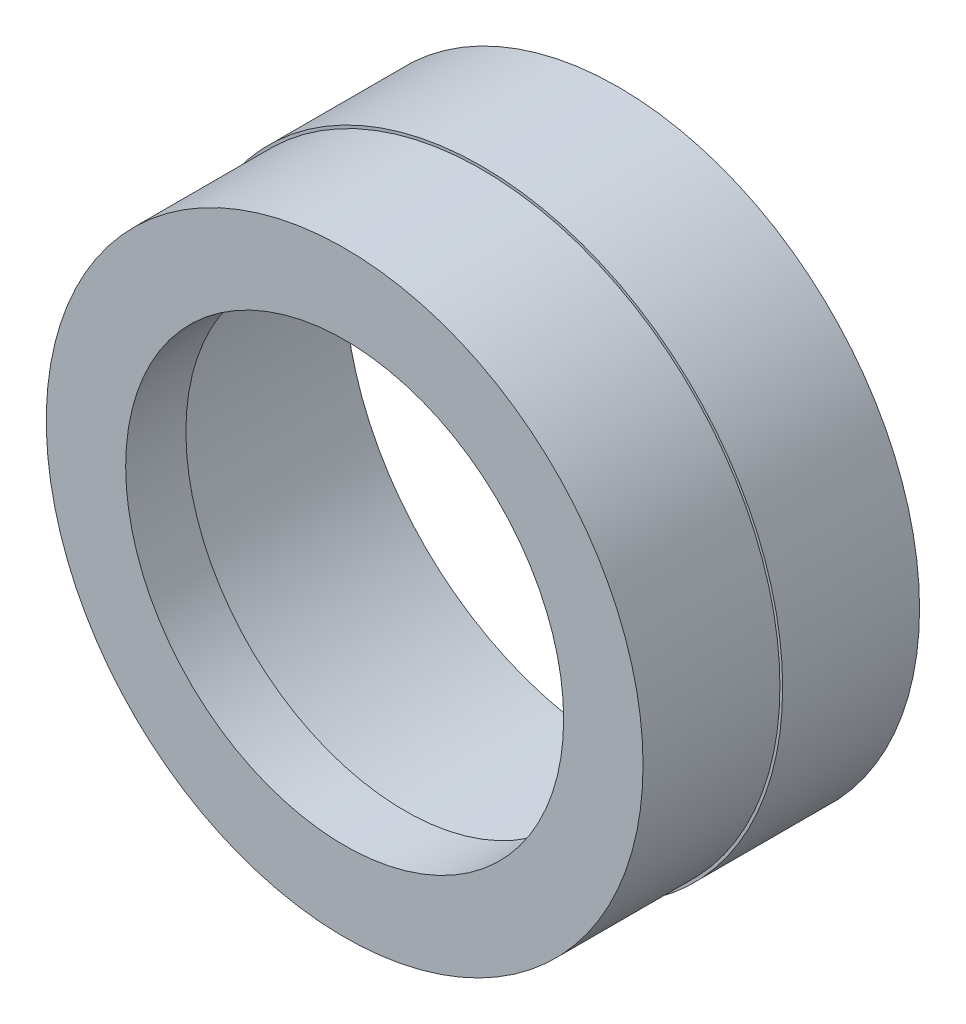
ISO-10303-21;
HEADER;
FILE_DESCRIPTION(('STEP AP214'),'2;1');
FILE_NAME('part.step','',(''),(''),'','','');
FILE_SCHEMA(('AUTOMOTIVE_DESIGN { 1 0 10303 214 1 1 1 1 }'));
ENDSEC;
DATA;
#1=APPLICATION_CONTEXT('core data for automotive mechanical design processes');
#2=APPLICATION_PROTOCOL_DEFINITION('international standard','automotive_design',2000,#1);
#3=PRODUCT_CONTEXT('',#1,'mechanical');
#4=PRODUCT('Part','Part','',(#3));
#5=PRODUCT_RELATED_PRODUCT_CATEGORY('part','',(#4));
#6=PRODUCT_DEFINITION_FORMATION('','',#4);
#7=PRODUCT_DEFINITION_CONTEXT('part definition',#1,'design');
#8=PRODUCT_DEFINITION('design','',#6,#7);
#9=PRODUCT_DEFINITION_SHAPE('','',#8);
#10=(LENGTH_UNIT() NAMED_UNIT(*) SI_UNIT(.MILLI.,.METRE.));
#11=(NAMED_UNIT(*) PLANE_ANGLE_UNIT() SI_UNIT($,.RADIAN.));
#12=(NAMED_UNIT(*) SI_UNIT($,.STERADIAN.) SOLID_ANGLE_UNIT());
#13=UNCERTAINTY_MEASURE_WITH_UNIT(LENGTH_MEASURE(1.E-05),#10,'distance_accuracy_value','');
#14=(GEOMETRIC_REPRESENTATION_CONTEXT(3) GLOBAL_UNCERTAINTY_ASSIGNED_CONTEXT((#13)) GLOBAL_UNIT_ASSIGNED_CONTEXT((#10,
#11,#12)) REPRESENTATION_CONTEXT('',''));
#15=CARTESIAN_POINT('',(0.,0.,0.));
#16=DIRECTION('',(0.,0.,1.));
#17=DIRECTION('',(1.,0.,0.));
#18=AXIS2_PLACEMENT_3D('',#15,#16,#17);
#19=CARTESIAN_POINT('',(0.,0.,-5.));
#20=DIRECTION('',(0.,0.,1.));
#21=DIRECTION('',(1.,0.,0.));
#22=AXIS2_PLACEMENT_3D('',#19,#20,#21);
#23=CYLINDRICAL_SURFACE('',#22,5.5);
#24=CARTESIAN_POINT('',(0.,0.,-5.));
#25=DIRECTION('',(0.,0.,1.));
#26=DIRECTION('',(1.,0.,0.));
#27=AXIS2_PLACEMENT_3D('',#24,#25,#26);
#28=CIRCLE('',#27,5.5);
#29=CARTESIAN_POINT('',(5.5,0.,-5.));
#30=VERTEX_POINT('',#29);
#31=EDGE_CURVE('E13',#30,#30,#28,.T.);
#32=ORIENTED_EDGE('',*,*,#31,.T.);
#33=EDGE_LOOP('',(#32));
#34=FACE_BOUND('',#33,.T.);
#35=CARTESIAN_POINT('',(0.,0.,-2.5));
#36=DIRECTION('',(0.,0.,1.));
#37=DIRECTION('',(1.,0.,0.));
#38=AXIS2_PLACEMENT_3D('',#35,#36,#37);
#39=CIRCLE('',#38,5.5);
#40=CARTESIAN_POINT('',(5.5,0.,-2.5));
#41=VERTEX_POINT('',#40);
#42=EDGE_CURVE('E51',#41,#41,#39,.F.);
#43=ORIENTED_EDGE('',*,*,#42,.T.);
#44=EDGE_LOOP('',(#43));
#45=FACE_BOUND('',#44,.T.);
#46=ADVANCED_FACE('F48',(#34,#45),#23,.T.);
#47=CARTESIAN_POINT('',(0.,0.,0.));
#48=DIRECTION('',(0.,0.,1.));
#49=DIRECTION('',(1.,0.,0.));
#50=AXIS2_PLACEMENT_3D('',#47,#48,#49);
#51=PLANE('',#50);
#52=CARTESIAN_POINT('',(0.,0.,0.));
#53=DIRECTION('',(0.,0.,1.));
#54=DIRECTION('',(1.,0.,0.));
#55=AXIS2_PLACEMENT_3D('',#52,#53,#54);
#56=CIRCLE('',#55,4.);
#57=CARTESIAN_POINT('',(4.,0.,0.));
#58=VERTEX_POINT('',#57);
#59=EDGE_CURVE('E63',#58,#58,#56,.T.);
#60=ORIENTED_EDGE('',*,*,#59,.F.);
#61=EDGE_LOOP('',(#60));
#62=FACE_BOUND('',#61,.T.);
#63=CARTESIAN_POINT('',(0.,0.,0.));
#64=DIRECTION('',(0.,0.,1.));
#65=DIRECTION('',(1.,0.,0.));
#66=AXIS2_PLACEMENT_3D('',#63,#64,#65);
#67=CIRCLE('',#66,5.45);
#68=CARTESIAN_POINT('',(5.45,0.,0.));
#69=VERTEX_POINT('',#68);
#70=EDGE_CURVE('E70',#69,#69,#67,.T.);
#71=ORIENTED_EDGE('',*,*,#70,.T.);
#72=EDGE_LOOP('',(#71));
#73=FACE_BOUND('',#72,.T.);
#74=ADVANCED_FACE('F96',(#62,#73),#51,.T.);
#75=CARTESIAN_POINT('',(0.,0.,-5.));
#76=DIRECTION('',(0.,0.,1.));
#77=DIRECTION('',(1.,0.,0.));
#78=AXIS2_PLACEMENT_3D('',#75,#76,#77);
#79=PLANE('',#78);
#80=CARTESIAN_POINT('',(0.,0.,-5.));
#81=DIRECTION('',(0.,0.,-1.));
#82=DIRECTION('',(-1.,0.,0.));
#83=AXIS2_PLACEMENT_3D('',#80,#81,#82);
#84=CIRCLE('',#83,5.);
#85=CARTESIAN_POINT('',(-5.,0.,-5.));
#86=VERTEX_POINT('',#85);
#87=EDGE_CURVE('E59',#86,#86,#84,.T.);
#88=ORIENTED_EDGE('',*,*,#87,.F.);
#89=EDGE_LOOP('',(#88));
#90=FACE_BOUND('',#89,.T.);
#91=ORIENTED_EDGE('',*,*,#31,.F.);
#92=EDGE_LOOP('',(#91));
#93=FACE_BOUND('',#92,.T.);
#94=ADVANCED_FACE('F100',(#90,#93),#79,.F.);
#95=CARTESIAN_POINT('',(0.,0.,-1.1));
#96=DIRECTION('',(0.,0.,-1.));
#97=DIRECTION('',(-1.,0.,0.));
#98=AXIS2_PLACEMENT_3D('',#95,#96,#97);
#99=CYLINDRICAL_SURFACE('',#98,5.);
#100=CARTESIAN_POINT('',(0.,0.,-1.1));
#101=DIRECTION('',(0.,0.,-1.));
#102=DIRECTION('',(-1.,0.,0.));
#103=AXIS2_PLACEMENT_3D('',#100,#101,#102);
#104=CIRCLE('',#103,5.);
#105=CARTESIAN_POINT('',(-5.,0.,-1.1));
#106=VERTEX_POINT('',#105);
#107=EDGE_CURVE('E55',#106,#106,#104,.T.);
#108=ORIENTED_EDGE('',*,*,#107,.F.);
#109=EDGE_LOOP('',(#108));
#110=FACE_BOUND('',#109,.T.);
#111=ORIENTED_EDGE('',*,*,#87,.T.);
#112=EDGE_LOOP('',(#111));
#113=FACE_BOUND('',#112,.T.);
#114=ADVANCED_FACE('F105',(#110,#113),#99,.F.);
#115=CARTESIAN_POINT('',(0.,0.,-1.1));
#116=DIRECTION('',(0.,0.,-1.));
#117=DIRECTION('',(-1.,0.,0.));
#118=AXIS2_PLACEMENT_3D('',#115,#116,#117);
#119=PLANE('',#118);
#120=CARTESIAN_POINT('',(0.,0.,-1.1));
#121=DIRECTION('',(0.,0.,-1.));
#122=DIRECTION('',(-1.,0.,0.));
#123=AXIS2_PLACEMENT_3D('',#120,#121,#122);
#124=CIRCLE('',#123,4.);
#125=CARTESIAN_POINT('',(-4.,0.,-1.1));
#126=VERTEX_POINT('',#125);
#127=EDGE_CURVE('E65',#126,#126,#124,.F.);
#128=ORIENTED_EDGE('',*,*,#127,.T.);
#129=EDGE_LOOP('',(#128));
#130=FACE_BOUND('',#129,.T.);
#131=ORIENTED_EDGE('',*,*,#107,.T.);
#132=EDGE_LOOP('',(#131));
#133=FACE_BOUND('',#132,.T.);
#134=ADVANCED_FACE('F92',(#130,#133),#119,.T.);
#135=CARTESIAN_POINT('',(0.,0.,-5.001));
#136=DIRECTION('',(0.,0.,1.));
#137=DIRECTION('',(1.,0.,0.));
#138=AXIS2_PLACEMENT_3D('',#135,#136,#137);
#139=CYLINDRICAL_SURFACE('',#138,4.);
#140=ORIENTED_EDGE('',*,*,#127,.F.);
#141=EDGE_LOOP('',(#140));
#142=FACE_BOUND('',#141,.T.);
#143=ORIENTED_EDGE('',*,*,#59,.T.);
#144=EDGE_LOOP('',(#143));
#145=FACE_BOUND('',#144,.T.);
#146=ADVANCED_FACE('F85',(#142,#145),#139,.F.);
#147=CARTESIAN_POINT('',(0.,0.,-2.5));
#148=DIRECTION('',(0.,0.,1.));
#149=DIRECTION('',(1.,0.,0.));
#150=AXIS2_PLACEMENT_3D('',#147,#148,#149);
#151=PLANE('',#150);
#152=ORIENTED_EDGE('',*,*,#42,.F.);
#153=EDGE_LOOP('',(#152));
#154=FACE_BOUND('',#153,.T.);
#155=CARTESIAN_POINT('',(0.,0.,-2.5));
#156=DIRECTION('',(0.,0.,1.));
#157=DIRECTION('',(1.,0.,0.));
#158=AXIS2_PLACEMENT_3D('',#155,#156,#157);
#159=CIRCLE('',#158,5.45);
#160=CARTESIAN_POINT('',(5.45,0.,-2.5));
#161=VERTEX_POINT('',#160);
#162=EDGE_CURVE('E73',#161,#161,#159,.T.);
#163=ORIENTED_EDGE('',*,*,#162,.F.);
#164=EDGE_LOOP('',(#163));
#165=FACE_BOUND('',#164,.T.);
#166=ADVANCED_FACE('F81',(#154,#165),#151,.T.);
#167=CARTESIAN_POINT('',(0.,0.,-2.5));
#168=DIRECTION('',(0.,0.,1.));
#169=DIRECTION('',(1.,0.,0.));
#170=AXIS2_PLACEMENT_3D('',#167,#168,#169);
#171=CYLINDRICAL_SURFACE('',#170,5.45);
#172=ORIENTED_EDGE('',*,*,#162,.T.);
#173=EDGE_LOOP('',(#172));
#174=FACE_BOUND('',#173,.T.);
#175=ORIENTED_EDGE('',*,*,#70,.F.);
#176=EDGE_LOOP('',(#175));
#177=FACE_BOUND('',#176,.T.);
#178=ADVANCED_FACE('F84',(#174,#177),#171,.T.);
#179=CLOSED_SHELL('',(#46,#74,#94,#114,#134,#146,#166,#178));
#180=MANIFOLD_SOLID_BREP('B2',#179);
#181=ADVANCED_BREP_SHAPE_REPRESENTATION('',(#18,#180),#14);
#182=SHAPE_DEFINITION_REPRESENTATION(#9,#181);
ENDSEC;
END-ISO-10303-21;
